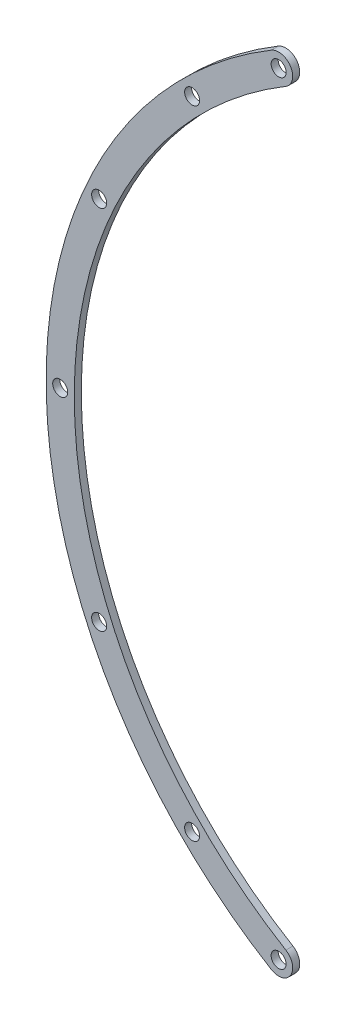
ISO-10303-21;
HEADER;
FILE_DESCRIPTION(('STEP AP214'),'2;1');
FILE_NAME('part.step','',(''),(''),'','','');
FILE_SCHEMA(('AUTOMOTIVE_DESIGN { 1 0 10303 214 1 1 1 1 }'));
ENDSEC;
DATA;
#1=APPLICATION_CONTEXT('core data for automotive mechanical design processes');
#2=APPLICATION_PROTOCOL_DEFINITION('international standard','automotive_design',2000,#1);
#3=PRODUCT_CONTEXT('',#1,'mechanical');
#4=PRODUCT('Part','Part','',(#3));
#5=PRODUCT_RELATED_PRODUCT_CATEGORY('part','',(#4));
#6=PRODUCT_DEFINITION_FORMATION('','',#4);
#7=PRODUCT_DEFINITION_CONTEXT('part definition',#1,'design');
#8=PRODUCT_DEFINITION('design','',#6,#7);
#9=PRODUCT_DEFINITION_SHAPE('','',#8);
#10=(LENGTH_UNIT() NAMED_UNIT(*) SI_UNIT(.MILLI.,.METRE.));
#11=(NAMED_UNIT(*) PLANE_ANGLE_UNIT() SI_UNIT($,.RADIAN.));
#12=(NAMED_UNIT(*) SI_UNIT($,.STERADIAN.) SOLID_ANGLE_UNIT());
#13=UNCERTAINTY_MEASURE_WITH_UNIT(LENGTH_MEASURE(1.E-05),#10,'distance_accuracy_value','');
#14=(GEOMETRIC_REPRESENTATION_CONTEXT(3) GLOBAL_UNCERTAINTY_ASSIGNED_CONTEXT((#13)) GLOBAL_UNIT_ASSIGNED_CONTEXT((#10,
#11,#12)) REPRESENTATION_CONTEXT('',''));
#15=CARTESIAN_POINT('',(0.,0.,0.));
#16=DIRECTION('',(0.,0.,1.));
#17=DIRECTION('',(1.,0.,0.));
#18=AXIS2_PLACEMENT_3D('',#15,#16,#17);
#19=CARTESIAN_POINT('',(0.,0.,1.5));
#20=DIRECTION('',(0.,0.,-1.));
#21=DIRECTION('',(-1.,0.,0.));
#22=AXIS2_PLACEMENT_3D('',#19,#20,#21);
#23=CYLINDRICAL_SURFACE('',#22,99.);
#24=CARTESIAN_POINT('',(0.,0.,0.));
#25=DIRECTION('',(0.,0.,1.));
#26=DIRECTION('',(1.,0.,0.));
#27=AXIS2_PLACEMENT_3D('',#24,#25,#26);
#28=CIRCLE('',#27,99.);
#29=CARTESIAN_POINT('',(-50.9887694160958,84.8595627695089,0.));
#30=VERTEX_POINT('',#29);
#31=CARTESIAN_POINT('',(-50.9887694160958,-84.8595627695088,0.));
#32=VERTEX_POINT('',#31);
#33=EDGE_CURVE('E92',#30,#32,#28,.T.);
#34=ORIENTED_EDGE('',*,*,#33,.T.);
#35=DIRECTION('',(0.,0.,1.));
#36=VECTOR('',#35,1.);
#37=CARTESIAN_POINT('',(-50.9887694160958,-84.8595627695088,-8.5));
#38=LINE('',#37,#36);
#39=CARTESIAN_POINT('',(-50.9887694160958,-84.8595627695088,1.5));
#40=VERTEX_POINT('',#39);
#41=EDGE_CURVE('E82',#32,#40,#38,.T.);
#42=ORIENTED_EDGE('',*,*,#41,.T.);
#43=CARTESIAN_POINT('',(0.,0.,1.5));
#44=DIRECTION('',(0.,0.,1.));
#45=DIRECTION('',(1.,0.,0.));
#46=AXIS2_PLACEMENT_3D('',#43,#44,#45);
#47=CIRCLE('',#46,99.);
#48=CARTESIAN_POINT('',(-50.9887694160958,84.8595627695089,1.5));
#49=VERTEX_POINT('',#48);
#50=EDGE_CURVE('E11',#49,#40,#47,.T.);
#51=ORIENTED_EDGE('',*,*,#50,.F.);
#52=DIRECTION('',(0.,0.,1.));
#53=VECTOR('',#52,1.);
#54=CARTESIAN_POINT('',(-50.9887694160958,84.8595627695089,-8.5));
#55=LINE('',#54,#53);
#56=EDGE_CURVE('E93',#30,#49,#55,.T.);
#57=ORIENTED_EDGE('',*,*,#56,.F.);
#58=EDGE_LOOP('',(#34,#42,#51,#57));
#59=FACE_BOUND('',#58,.T.);
#60=ADVANCED_FACE('F35',(#59),#23,.T.);
#61=CARTESIAN_POINT('',(0.,0.,1.5));
#62=DIRECTION('',(0.,0.,1.));
#63=DIRECTION('',(1.,0.,0.));
#64=AXIS2_PLACEMENT_3D('',#61,#62,#63);
#65=PLANE('',#64);
#66=CARTESIAN_POINT('',(-67.8822509939086,67.8822509939086,1.5));
#67=DIRECTION('',(0.,0.,1.));
#68=DIRECTION('',(1.,0.,0.));
#69=AXIS2_PLACEMENT_3D('',#66,#67,#68);
#70=CIRCLE('',#69,1.60000000000001);
#71=CARTESIAN_POINT('',(-66.2822509939085,67.8822509939086,1.5));
#72=VERTEX_POINT('',#71);
#73=EDGE_CURVE('E141',#72,#72,#70,.T.);
#74=ORIENTED_EDGE('',*,*,#73,.F.);
#75=EDGE_LOOP('',(#74));
#76=FACE_BOUND('',#75,.T.);
#77=CARTESIAN_POINT('',(-96.,0.,1.5));
#78=DIRECTION('',(0.,0.,1.));
#79=DIRECTION('',(1.,0.,0.));
#80=AXIS2_PLACEMENT_3D('',#77,#78,#79);
#81=CIRCLE('',#80,1.60000000000001);
#82=CARTESIAN_POINT('',(-94.4,0.,1.5));
#83=VERTEX_POINT('',#82);
#84=EDGE_CURVE('E715',#83,#83,#81,.T.);
#85=ORIENTED_EDGE('',*,*,#84,.F.);
#86=EDGE_LOOP('',(#85));
#87=FACE_BOUND('',#86,.T.);
#88=CARTESIAN_POINT('',(-67.8822509939086,-67.8822509939086,1.5));
#89=DIRECTION('',(0.,0.,1.));
#90=DIRECTION('',(1.,0.,0.));
#91=AXIS2_PLACEMENT_3D('',#88,#89,#90);
#92=CIRCLE('',#91,1.60000000000001);
#93=CARTESIAN_POINT('',(-66.2822509939085,-67.8822509939086,1.5));
#94=VERTEX_POINT('',#93);
#95=EDGE_CURVE('E200',#94,#94,#92,.T.);
#96=ORIENTED_EDGE('',*,*,#95,.F.);
#97=EDGE_LOOP('',(#96));
#98=FACE_BOUND('',#97,.T.);
#99=CARTESIAN_POINT('',(0.,0.,1.5));
#100=DIRECTION('',(0.,0.,1.));
#101=DIRECTION('',(1.,0.,0.));
#102=AXIS2_PLACEMENT_3D('',#99,#100,#101);
#103=CIRCLE('',#102,93.);
#104=CARTESIAN_POINT('',(-47.8985409666354,79.7165589652962,1.5));
#105=VERTEX_POINT('',#104);
#106=CARTESIAN_POINT('',(-47.8985409666355,-79.7165589652962,1.5));
#107=VERTEX_POINT('',#106);
#108=EDGE_CURVE('E44',#105,#107,#103,.T.);
#109=ORIENTED_EDGE('',*,*,#108,.F.);
#110=CARTESIAN_POINT('',(-49.4436551913656,82.2880608674025,1.5));
#111=DIRECTION('',(0.,0.,-1.));
#112=DIRECTION('',(1.,0.,0.));
#113=AXIS2_PLACEMENT_3D('',#110,#111,#112);
#114=CIRCLE('',#113,3.00000000000004);
#115=EDGE_CURVE('E85',#49,#105,#114,.T.);
#116=ORIENTED_EDGE('',*,*,#115,.F.);
#117=ORIENTED_EDGE('',*,*,#50,.T.);
#118=CARTESIAN_POINT('',(-49.4436551913656,-82.2880608674025,1.5));
#119=DIRECTION('',(0.,0.,-1.));
#120=DIRECTION('',(1.,0.,0.));
#121=AXIS2_PLACEMENT_3D('',#118,#119,#120);
#122=CIRCLE('',#121,2.99999999999998);
#123=EDGE_CURVE('E79',#107,#40,#122,.T.);
#124=ORIENTED_EDGE('',*,*,#123,.F.);
#125=EDGE_LOOP('',(#109,#116,#117,#124));
#126=FACE_BOUND('',#125,.T.);
#127=CARTESIAN_POINT('',(-49.4436551913656,82.2880608674025,1.5));
#128=DIRECTION('',(0.,0.,1.));
#129=DIRECTION('',(1.,0.,0.));
#130=AXIS2_PLACEMENT_3D('',#127,#128,#129);
#131=CIRCLE('',#130,1.6);
#132=CARTESIAN_POINT('',(-47.8436551913656,82.2880608674025,1.5));
#133=VERTEX_POINT('',#132);
#134=EDGE_CURVE('E115',#133,#133,#131,.T.);
#135=ORIENTED_EDGE('',*,*,#134,.F.);
#136=EDGE_LOOP('',(#135));
#137=FACE_BOUND('',#136,.T.);
#138=CARTESIAN_POINT('',(-87.7003639336899,39.0467177352763,1.5));
#139=DIRECTION('',(0.,0.,1.));
#140=DIRECTION('',(1.,0.,0.));
#141=AXIS2_PLACEMENT_3D('',#138,#139,#140);
#142=CIRCLE('',#141,1.60000000000001);
#143=CARTESIAN_POINT('',(-86.1003639336899,39.0467177352763,1.5));
#144=VERTEX_POINT('',#143);
#145=EDGE_CURVE('E127',#144,#144,#142,.T.);
#146=ORIENTED_EDGE('',*,*,#145,.F.);
#147=EDGE_LOOP('',(#146));
#148=FACE_BOUND('',#147,.T.);
#149=CARTESIAN_POINT('',(-87.7003639336899,-39.0467177352763,1.5));
#150=DIRECTION('',(0.,0.,1.));
#151=DIRECTION('',(-1.,0.,0.));
#152=AXIS2_PLACEMENT_3D('',#149,#150,#151);
#153=CIRCLE('',#152,1.60000000000001);
#154=CARTESIAN_POINT('',(-89.3003639336899,-39.0467177352763,1.5));
#155=VERTEX_POINT('',#154);
#156=EDGE_CURVE('E121',#155,#155,#153,.T.);
#157=ORIENTED_EDGE('',*,*,#156,.F.);
#158=EDGE_LOOP('',(#157));
#159=FACE_BOUND('',#158,.T.);
#160=CARTESIAN_POINT('',(-49.4436551913656,-82.2880608674025,1.5));
#161=DIRECTION('',(0.,0.,1.));
#162=DIRECTION('',(1.,0.,0.));
#163=AXIS2_PLACEMENT_3D('',#160,#161,#162);
#164=CIRCLE('',#163,1.6);
#165=CARTESIAN_POINT('',(-47.8436551913656,-82.2880608674025,1.5));
#166=VERTEX_POINT('',#165);
#167=EDGE_CURVE('E111',#166,#166,#164,.F.);
#168=ORIENTED_EDGE('',*,*,#167,.T.);
#169=EDGE_LOOP('',(#168));
#170=FACE_BOUND('',#169,.T.);
#171=ADVANCED_FACE('F96',(#76,#87,#98,#126,#137,#148,#159,#170),#65,.T.);
#172=CARTESIAN_POINT('',(0.,0.,0.));
#173=DIRECTION('',(0.,0.,1.));
#174=DIRECTION('',(1.,0.,0.));
#175=AXIS2_PLACEMENT_3D('',#172,#173,#174);
#176=PLANE('',#175);
#177=CARTESIAN_POINT('',(-67.8822509939086,67.8822509939086,0.));
#178=DIRECTION('',(0.,0.,1.));
#179=DIRECTION('',(1.,0.,0.));
#180=AXIS2_PLACEMENT_3D('',#177,#178,#179);
#181=CIRCLE('',#180,1.60000000000001);
#182=CARTESIAN_POINT('',(-66.2822509939085,67.8822509939086,0.));
#183=VERTEX_POINT('',#182);
#184=EDGE_CURVE('E39',#183,#183,#181,.T.);
#185=ORIENTED_EDGE('',*,*,#184,.T.);
#186=EDGE_LOOP('',(#185));
#187=FACE_BOUND('',#186,.T.);
#188=CARTESIAN_POINT('',(-96.,0.,0.));
#189=DIRECTION('',(0.,0.,1.));
#190=DIRECTION('',(1.,0.,0.));
#191=AXIS2_PLACEMENT_3D('',#188,#189,#190);
#192=CIRCLE('',#191,1.60000000000001);
#193=CARTESIAN_POINT('',(-94.4,0.,0.));
#194=VERTEX_POINT('',#193);
#195=EDGE_CURVE('E140',#194,#194,#192,.T.);
#196=ORIENTED_EDGE('',*,*,#195,.T.);
#197=EDGE_LOOP('',(#196));
#198=FACE_BOUND('',#197,.T.);
#199=CARTESIAN_POINT('',(-67.8822509939086,-67.8822509939086,0.));
#200=DIRECTION('',(0.,0.,1.));
#201=DIRECTION('',(1.,0.,0.));
#202=AXIS2_PLACEMENT_3D('',#199,#200,#201);
#203=CIRCLE('',#202,1.60000000000001);
#204=CARTESIAN_POINT('',(-66.2822509939085,-67.8822509939086,0.));
#205=VERTEX_POINT('',#204);
#206=EDGE_CURVE('E138',#205,#205,#203,.T.);
#207=ORIENTED_EDGE('',*,*,#206,.T.);
#208=EDGE_LOOP('',(#207));
#209=FACE_BOUND('',#208,.T.);
#210=CARTESIAN_POINT('',(-49.4436551913656,82.2880608674025,0.));
#211=DIRECTION('',(0.,0.,1.));
#212=DIRECTION('',(1.,0.,0.));
#213=AXIS2_PLACEMENT_3D('',#210,#211,#212);
#214=CIRCLE('',#213,3.00000000000004);
#215=CARTESIAN_POINT('',(-47.8985409666354,79.7165589652962,0.));
#216=VERTEX_POINT('',#215);
#217=EDGE_CURVE('E104',#30,#216,#214,.F.);
#218=ORIENTED_EDGE('',*,*,#217,.T.);
#219=CARTESIAN_POINT('',(0.,0.,0.));
#220=DIRECTION('',(0.,0.,1.));
#221=DIRECTION('',(1.,0.,0.));
#222=AXIS2_PLACEMENT_3D('',#219,#220,#221);
#223=CIRCLE('',#222,93.);
#224=CARTESIAN_POINT('',(-47.8985409666355,-79.7165589652962,0.));
#225=VERTEX_POINT('',#224);
#226=EDGE_CURVE('E52',#216,#225,#223,.T.);
#227=ORIENTED_EDGE('',*,*,#226,.T.);
#228=CARTESIAN_POINT('',(-49.4436551913656,-82.2880608674025,0.));
#229=DIRECTION('',(0.,0.,1.));
#230=DIRECTION('',(1.,0.,0.));
#231=AXIS2_PLACEMENT_3D('',#228,#229,#230);
#232=CIRCLE('',#231,2.99999999999998);
#233=EDGE_CURVE('E109',#225,#32,#232,.F.);
#234=ORIENTED_EDGE('',*,*,#233,.T.);
#235=ORIENTED_EDGE('',*,*,#33,.F.);
#236=EDGE_LOOP('',(#218,#227,#234,#235));
#237=FACE_BOUND('',#236,.T.);
#238=CARTESIAN_POINT('',(-49.4436551913656,82.2880608674025,0.));
#239=DIRECTION('',(0.,0.,1.));
#240=DIRECTION('',(1.,0.,0.));
#241=AXIS2_PLACEMENT_3D('',#238,#239,#240);
#242=CIRCLE('',#241,1.6);
#243=CARTESIAN_POINT('',(-47.8436551913656,82.2880608674025,0.));
#244=VERTEX_POINT('',#243);
#245=EDGE_CURVE('E118',#244,#244,#242,.T.);
#246=ORIENTED_EDGE('',*,*,#245,.T.);
#247=EDGE_LOOP('',(#246));
#248=FACE_BOUND('',#247,.T.);
#249=CARTESIAN_POINT('',(-87.7003639336899,39.0467177352763,0.));
#250=DIRECTION('',(0.,0.,1.));
#251=DIRECTION('',(1.,0.,0.));
#252=AXIS2_PLACEMENT_3D('',#249,#250,#251);
#253=CIRCLE('',#252,1.60000000000001);
#254=CARTESIAN_POINT('',(-86.1003639336899,39.0467177352763,0.));
#255=VERTEX_POINT('',#254);
#256=EDGE_CURVE('E130',#255,#255,#253,.T.);
#257=ORIENTED_EDGE('',*,*,#256,.T.);
#258=EDGE_LOOP('',(#257));
#259=FACE_BOUND('',#258,.T.);
#260=CARTESIAN_POINT('',(-87.7003639336899,-39.0467177352763,0.));
#261=DIRECTION('',(0.,0.,1.));
#262=DIRECTION('',(-1.,0.,0.));
#263=AXIS2_PLACEMENT_3D('',#260,#261,#262);
#264=CIRCLE('',#263,1.60000000000001);
#265=CARTESIAN_POINT('',(-89.3003639336899,-39.0467177352763,0.));
#266=VERTEX_POINT('',#265);
#267=EDGE_CURVE('E124',#266,#266,#264,.T.);
#268=ORIENTED_EDGE('',*,*,#267,.T.);
#269=EDGE_LOOP('',(#268));
#270=FACE_BOUND('',#269,.T.);
#271=CARTESIAN_POINT('',(-49.4436551913656,-82.2880608674025,0.));
#272=DIRECTION('',(0.,0.,1.));
#273=DIRECTION('',(1.,0.,0.));
#274=AXIS2_PLACEMENT_3D('',#271,#272,#273);
#275=CIRCLE('',#274,1.6);
#276=CARTESIAN_POINT('',(-47.8436551913656,-82.2880608674025,0.));
#277=VERTEX_POINT('',#276);
#278=EDGE_CURVE('E112',#277,#277,#275,.F.);
#279=ORIENTED_EDGE('',*,*,#278,.F.);
#280=EDGE_LOOP('',(#279));
#281=FACE_BOUND('',#280,.T.);
#282=ADVANCED_FACE('F148',(#187,#198,#209,#237,#248,#259,#270,#281),#176,.F.);
#283=CARTESIAN_POINT('',(0.,0.,1.5));
#284=DIRECTION('',(0.,0.,-1.));
#285=DIRECTION('',(-1.,0.,0.));
#286=AXIS2_PLACEMENT_3D('',#283,#284,#285);
#287=CYLINDRICAL_SURFACE('',#286,93.);
#288=DIRECTION('',(0.,0.,1.));
#289=VECTOR('',#288,1.);
#290=CARTESIAN_POINT('',(-47.8985409666355,-79.7165589652962,-8.5));
#291=LINE('',#290,#289);
#292=EDGE_CURVE('E83',#225,#107,#291,.T.);
#293=ORIENTED_EDGE('',*,*,#292,.F.);
#294=ORIENTED_EDGE('',*,*,#226,.F.);
#295=DIRECTION('',(0.,0.,1.));
#296=VECTOR('',#295,1.);
#297=CARTESIAN_POINT('',(-47.8985409666354,79.7165589652962,-8.5));
#298=LINE('',#297,#296);
#299=EDGE_CURVE('E105',#216,#105,#298,.T.);
#300=ORIENTED_EDGE('',*,*,#299,.T.);
#301=ORIENTED_EDGE('',*,*,#108,.T.);
#302=EDGE_LOOP('',(#293,#294,#300,#301));
#303=FACE_BOUND('',#302,.T.);
#304=ADVANCED_FACE('F37',(#303),#287,.F.);
#305=CARTESIAN_POINT('',(-87.7003639336899,39.0467177352763,0.));
#306=DIRECTION('',(0.,0.,1.));
#307=DIRECTION('',(1.,0.,0.));
#308=AXIS2_PLACEMENT_3D('',#305,#306,#307);
#309=CYLINDRICAL_SURFACE('',#308,1.60000000000001);
#310=ORIENTED_EDGE('',*,*,#256,.F.);
#311=EDGE_LOOP('',(#310));
#312=FACE_BOUND('',#311,.T.);
#313=ORIENTED_EDGE('',*,*,#145,.T.);
#314=EDGE_LOOP('',(#313));
#315=FACE_BOUND('',#314,.T.);
#316=ADVANCED_FACE('F173',(#312,#315),#309,.F.);
#317=CARTESIAN_POINT('',(-87.7003639336899,-39.0467177352763,0.));
#318=DIRECTION('',(0.,0.,1.));
#319=DIRECTION('',(1.,0.,0.));
#320=AXIS2_PLACEMENT_3D('',#317,#318,#319);
#321=CYLINDRICAL_SURFACE('',#320,1.60000000000001);
#322=ORIENTED_EDGE('',*,*,#267,.F.);
#323=EDGE_LOOP('',(#322));
#324=FACE_BOUND('',#323,.T.);
#325=ORIENTED_EDGE('',*,*,#156,.T.);
#326=EDGE_LOOP('',(#325));
#327=FACE_BOUND('',#326,.T.);
#328=ADVANCED_FACE('F176',(#324,#327),#321,.F.);
#329=CARTESIAN_POINT('',(-49.4436551913656,82.2880608674025,0.));
#330=DIRECTION('',(0.,0.,1.));
#331=DIRECTION('',(1.,0.,0.));
#332=AXIS2_PLACEMENT_3D('',#329,#330,#331);
#333=CYLINDRICAL_SURFACE('',#332,1.6);
#334=ORIENTED_EDGE('',*,*,#245,.F.);
#335=EDGE_LOOP('',(#334));
#336=FACE_BOUND('',#335,.T.);
#337=ORIENTED_EDGE('',*,*,#134,.T.);
#338=EDGE_LOOP('',(#337));
#339=FACE_BOUND('',#338,.T.);
#340=ADVANCED_FACE('F180',(#336,#339),#333,.F.);
#341=CARTESIAN_POINT('',(-49.4436551913656,-82.2880608674025,0.));
#342=DIRECTION('',(0.,0.,1.));
#343=DIRECTION('',(1.,0.,0.));
#344=AXIS2_PLACEMENT_3D('',#341,#342,#343);
#345=CYLINDRICAL_SURFACE('',#344,1.6);
#346=ORIENTED_EDGE('',*,*,#278,.T.);
#347=EDGE_LOOP('',(#346));
#348=FACE_BOUND('',#347,.T.);
#349=ORIENTED_EDGE('',*,*,#167,.F.);
#350=EDGE_LOOP('',(#349));
#351=FACE_BOUND('',#350,.T.);
#352=ADVANCED_FACE('F184',(#348,#351),#345,.F.);
#353=CARTESIAN_POINT('',(-49.4436551913656,-82.2880608674025,-8.5));
#354=DIRECTION('',(0.,0.,1.));
#355=DIRECTION('',(1.,0.,0.));
#356=AXIS2_PLACEMENT_3D('',#353,#354,#355);
#357=CYLINDRICAL_SURFACE('',#356,2.99999999999998);
#358=ORIENTED_EDGE('',*,*,#292,.T.);
#359=ORIENTED_EDGE('',*,*,#123,.T.);
#360=ORIENTED_EDGE('',*,*,#41,.F.);
#361=ORIENTED_EDGE('',*,*,#233,.F.);
#362=EDGE_LOOP('',(#358,#359,#360,#361));
#363=FACE_BOUND('',#362,.T.);
#364=ADVANCED_FACE('F81',(#363),#357,.T.);
#365=CARTESIAN_POINT('',(-49.4436551913656,82.2880608674025,-8.5));
#366=DIRECTION('',(0.,0.,1.));
#367=DIRECTION('',(1.,0.,0.));
#368=AXIS2_PLACEMENT_3D('',#365,#366,#367);
#369=CYLINDRICAL_SURFACE('',#368,3.00000000000004);
#370=ORIENTED_EDGE('',*,*,#56,.T.);
#371=ORIENTED_EDGE('',*,*,#115,.T.);
#372=ORIENTED_EDGE('',*,*,#299,.F.);
#373=ORIENTED_EDGE('',*,*,#217,.F.);
#374=EDGE_LOOP('',(#370,#371,#372,#373));
#375=FACE_BOUND('',#374,.T.);
#376=ADVANCED_FACE('F190',(#375),#369,.T.);
#377=CARTESIAN_POINT('',(-67.8822509939086,-67.8822509939086,-8.5));
#378=DIRECTION('',(0.,0.,1.));
#379=DIRECTION('',(1.,0.,0.));
#380=AXIS2_PLACEMENT_3D('',#377,#378,#379);
#381=CYLINDRICAL_SURFACE('',#380,1.60000000000001);
#382=ORIENTED_EDGE('',*,*,#95,.T.);
#383=EDGE_LOOP('',(#382));
#384=FACE_BOUND('',#383,.T.);
#385=ORIENTED_EDGE('',*,*,#206,.F.);
#386=EDGE_LOOP('',(#385));
#387=FACE_BOUND('',#386,.T.);
#388=ADVANCED_FACE('F158',(#384,#387),#381,.F.);
#389=CARTESIAN_POINT('',(-96.,0.,-8.5));
#390=DIRECTION('',(0.,0.,1.));
#391=DIRECTION('',(1.,0.,0.));
#392=AXIS2_PLACEMENT_3D('',#389,#390,#391);
#393=CYLINDRICAL_SURFACE('',#392,1.60000000000001);
#394=ORIENTED_EDGE('',*,*,#84,.T.);
#395=EDGE_LOOP('',(#394));
#396=FACE_BOUND('',#395,.T.);
#397=ORIENTED_EDGE('',*,*,#195,.F.);
#398=EDGE_LOOP('',(#397));
#399=FACE_BOUND('',#398,.T.);
#400=ADVANCED_FACE('F152',(#396,#399),#393,.F.);
#401=CARTESIAN_POINT('',(-67.8822509939086,67.8822509939086,-8.5));
#402=DIRECTION('',(0.,0.,1.));
#403=DIRECTION('',(1.,0.,0.));
#404=AXIS2_PLACEMENT_3D('',#401,#402,#403);
#405=CYLINDRICAL_SURFACE('',#404,1.60000000000001);
#406=ORIENTED_EDGE('',*,*,#73,.T.);
#407=EDGE_LOOP('',(#406));
#408=FACE_BOUND('',#407,.T.);
#409=ORIENTED_EDGE('',*,*,#184,.F.);
#410=EDGE_LOOP('',(#409));
#411=FACE_BOUND('',#410,.T.);
#412=ADVANCED_FACE('F150',(#408,#411),#405,.F.);
#413=CLOSED_SHELL('',(#60,#171,#282,#304,#316,#328,#340,#352,#364,#376,#388,#400,#412));
#414=MANIFOLD_SOLID_BREP('B2',#413);
#415=ADVANCED_BREP_SHAPE_REPRESENTATION('',(#18,#414),#14);
#416=SHAPE_DEFINITION_REPRESENTATION(#9,#415);
ENDSEC;
END-ISO-10303-21;
